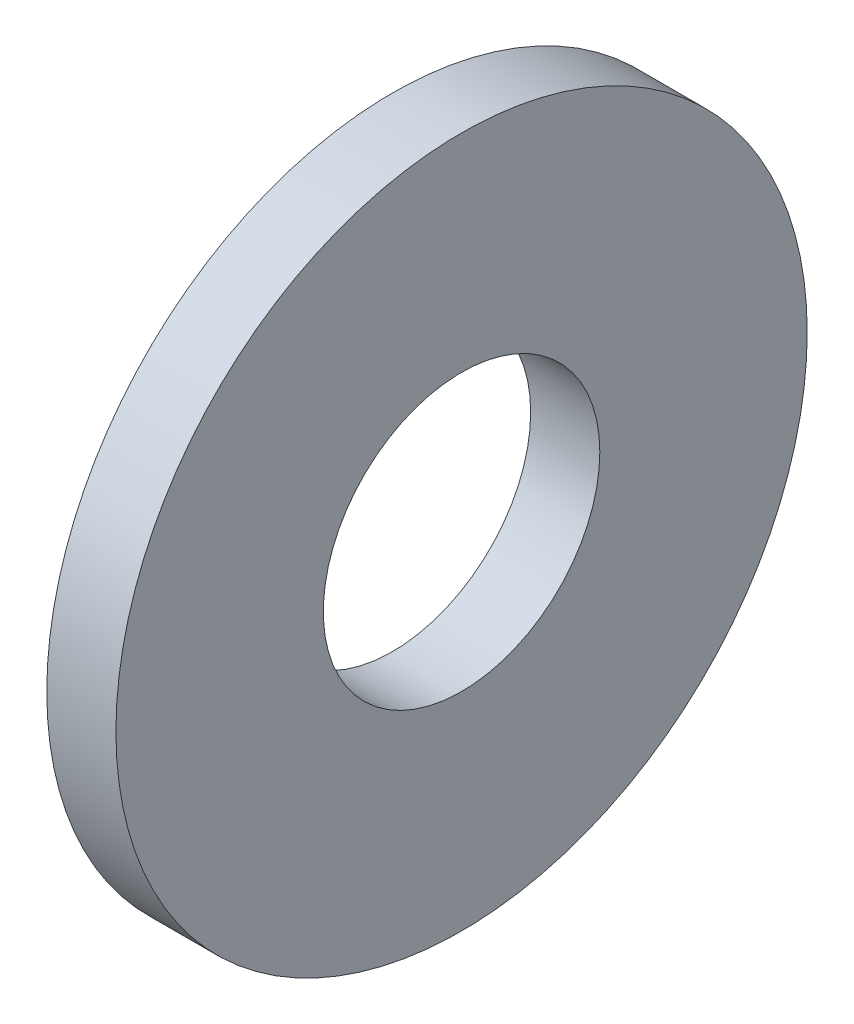
ISO-10303-21;
HEADER;
FILE_DESCRIPTION(('STEP AP214'),'2;1');
FILE_NAME('part.step','',(''),(''),'','','');
FILE_SCHEMA(('AUTOMOTIVE_DESIGN { 1 0 10303 214 1 1 1 1 }'));
ENDSEC;
DATA;
#1=APPLICATION_CONTEXT('core data for automotive mechanical design processes');
#2=APPLICATION_PROTOCOL_DEFINITION('international standard','automotive_design',2000,#1);
#3=PRODUCT_CONTEXT('',#1,'mechanical');
#4=PRODUCT('Part','Part','',(#3));
#5=PRODUCT_RELATED_PRODUCT_CATEGORY('part','',(#4));
#6=PRODUCT_DEFINITION_FORMATION('','',#4);
#7=PRODUCT_DEFINITION_CONTEXT('part definition',#1,'design');
#8=PRODUCT_DEFINITION('design','',#6,#7);
#9=PRODUCT_DEFINITION_SHAPE('','',#8);
#10=(LENGTH_UNIT() NAMED_UNIT(*) SI_UNIT(.MILLI.,.METRE.));
#11=(NAMED_UNIT(*) PLANE_ANGLE_UNIT() SI_UNIT($,.RADIAN.));
#12=(NAMED_UNIT(*) SI_UNIT($,.STERADIAN.) SOLID_ANGLE_UNIT());
#13=UNCERTAINTY_MEASURE_WITH_UNIT(LENGTH_MEASURE(1.E-05),#10,'distance_accuracy_value','');
#14=(GEOMETRIC_REPRESENTATION_CONTEXT(3) GLOBAL_UNCERTAINTY_ASSIGNED_CONTEXT((#13)) GLOBAL_UNIT_ASSIGNED_CONTEXT((#10,
#11,#12)) REPRESENTATION_CONTEXT('',''));
#15=CARTESIAN_POINT('',(0.,0.,0.));
#16=DIRECTION('',(0.,0.,1.));
#17=DIRECTION('',(1.,0.,0.));
#18=AXIS2_PLACEMENT_3D('',#15,#16,#17);
#19=CARTESIAN_POINT('',(1.,0.,0.));
#20=DIRECTION('',(1.,0.,0.));
#21=DIRECTION('',(0.,0.,-1.));
#22=AXIS2_PLACEMENT_3D('',#19,#20,#21);
#23=PLANE('',#22);
#24=CARTESIAN_POINT('',(1.,0.,0.));
#25=DIRECTION('',(1.,0.,0.));
#26=DIRECTION('',(0.,0.,-1.));
#27=AXIS2_PLACEMENT_3D('',#24,#25,#26);
#28=CIRCLE('',#27,5.);
#29=CARTESIAN_POINT('',(1.,0.,-5.));
#30=VERTEX_POINT('',#29);
#31=EDGE_CURVE('E10',#30,#30,#28,.T.);
#32=ORIENTED_EDGE('',*,*,#31,.T.);
#33=EDGE_LOOP('',(#32));
#34=FACE_BOUND('',#33,.T.);
#35=CARTESIAN_POINT('',(1.,0.,0.));
#36=DIRECTION('',(1.,0.,0.));
#37=DIRECTION('',(0.,0.,-1.));
#38=AXIS2_PLACEMENT_3D('',#35,#36,#37);
#39=CIRCLE('',#38,2.);
#40=CARTESIAN_POINT('',(1.,0.,-2.));
#41=VERTEX_POINT('',#40);
#42=EDGE_CURVE('E41',#41,#41,#39,.T.);
#43=ORIENTED_EDGE('',*,*,#42,.F.);
#44=EDGE_LOOP('',(#43));
#45=FACE_BOUND('',#44,.T.);
#46=ADVANCED_FACE('F30',(#34,#45),#23,.T.);
#47=CARTESIAN_POINT('',(0.,0.,0.));
#48=DIRECTION('',(1.,0.,0.));
#49=DIRECTION('',(0.,0.,-1.));
#50=AXIS2_PLACEMENT_3D('',#47,#48,#49);
#51=PLANE('',#50);
#52=CARTESIAN_POINT('',(0.,0.,0.));
#53=DIRECTION('',(1.,0.,0.));
#54=DIRECTION('',(0.,0.,-1.));
#55=AXIS2_PLACEMENT_3D('',#52,#53,#54);
#56=CIRCLE('',#55,5.);
#57=CARTESIAN_POINT('',(0.,0.,-5.));
#58=VERTEX_POINT('',#57);
#59=EDGE_CURVE('E34',#58,#58,#56,.T.);
#60=ORIENTED_EDGE('',*,*,#59,.F.);
#61=EDGE_LOOP('',(#60));
#62=FACE_BOUND('',#61,.T.);
#63=CARTESIAN_POINT('',(0.,0.,0.));
#64=DIRECTION('',(1.,0.,0.));
#65=DIRECTION('',(0.,0.,-1.));
#66=AXIS2_PLACEMENT_3D('',#63,#64,#65);
#67=CIRCLE('',#66,2.);
#68=CARTESIAN_POINT('',(0.,0.,-2.));
#69=VERTEX_POINT('',#68);
#70=EDGE_CURVE('E43',#69,#69,#67,.T.);
#71=ORIENTED_EDGE('',*,*,#70,.T.);
#72=EDGE_LOOP('',(#71));
#73=FACE_BOUND('',#72,.T.);
#74=ADVANCED_FACE('F53',(#62,#73),#51,.F.);
#75=CARTESIAN_POINT('',(1.,0.,0.));
#76=DIRECTION('',(-1.,0.,0.));
#77=DIRECTION('',(0.,0.,1.));
#78=AXIS2_PLACEMENT_3D('',#75,#76,#77);
#79=CYLINDRICAL_SURFACE('',#78,5.);
#80=ORIENTED_EDGE('',*,*,#31,.F.);
#81=EDGE_LOOP('',(#80));
#82=FACE_BOUND('',#81,.T.);
#83=ORIENTED_EDGE('',*,*,#59,.T.);
#84=EDGE_LOOP('',(#83));
#85=FACE_BOUND('',#84,.T.);
#86=ADVANCED_FACE('F32',(#82,#85),#79,.T.);
#87=CARTESIAN_POINT('',(1.,0.,0.));
#88=DIRECTION('',(-1.,0.,0.));
#89=DIRECTION('',(0.,0.,1.));
#90=AXIS2_PLACEMENT_3D('',#87,#88,#89);
#91=CYLINDRICAL_SURFACE('',#90,2.);
#92=ORIENTED_EDGE('',*,*,#42,.T.);
#93=EDGE_LOOP('',(#92));
#94=FACE_BOUND('',#93,.T.);
#95=ORIENTED_EDGE('',*,*,#70,.F.);
#96=EDGE_LOOP('',(#95));
#97=FACE_BOUND('',#96,.T.);
#98=ADVANCED_FACE('F49',(#94,#97),#91,.F.);
#99=CLOSED_SHELL('',(#46,#74,#86,#98));
#100=MANIFOLD_SOLID_BREP('B2',#99);
#101=ADVANCED_BREP_SHAPE_REPRESENTATION('',(#18,#100),#14);
#102=SHAPE_DEFINITION_REPRESENTATION(#9,#101);
ENDSEC;
END-ISO-10303-21;
